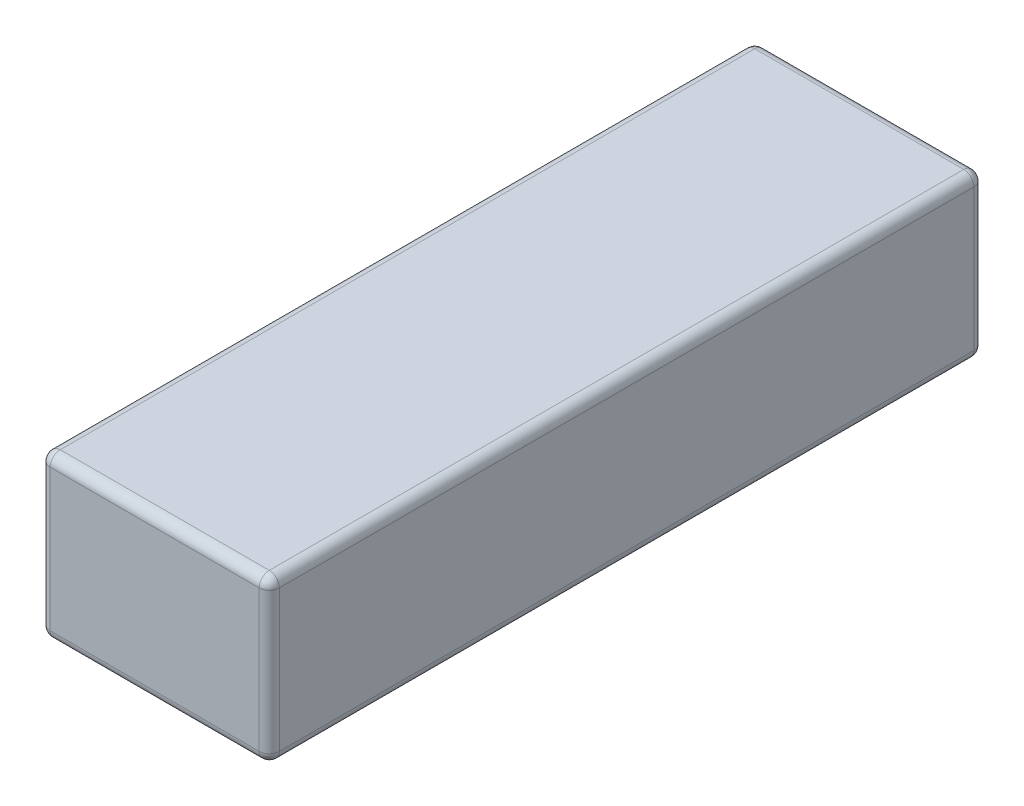
ISO-10303-21;
HEADER;
FILE_DESCRIPTION(('STEP AP214'),'2;1');
FILE_NAME('part.step','',(''),(''),'','','');
FILE_SCHEMA(('AUTOMOTIVE_DESIGN { 1 0 10303 214 1 1 1 1 }'));
ENDSEC;
DATA;
#1=APPLICATION_CONTEXT('core data for automotive mechanical design processes');
#2=APPLICATION_PROTOCOL_DEFINITION('international standard','automotive_design',2000,#1);
#3=PRODUCT_CONTEXT('',#1,'mechanical');
#4=PRODUCT('Part','Part','',(#3));
#5=PRODUCT_RELATED_PRODUCT_CATEGORY('part','',(#4));
#6=PRODUCT_DEFINITION_FORMATION('','',#4);
#7=PRODUCT_DEFINITION_CONTEXT('part definition',#1,'design');
#8=PRODUCT_DEFINITION('design','',#6,#7);
#9=PRODUCT_DEFINITION_SHAPE('','',#8);
#10=(LENGTH_UNIT() NAMED_UNIT(*) SI_UNIT(.MILLI.,.METRE.));
#11=(NAMED_UNIT(*) PLANE_ANGLE_UNIT() SI_UNIT($,.RADIAN.));
#12=(NAMED_UNIT(*) SI_UNIT($,.STERADIAN.) SOLID_ANGLE_UNIT());
#13=UNCERTAINTY_MEASURE_WITH_UNIT(LENGTH_MEASURE(1.E-05),#10,'distance_accuracy_value','');
#14=(GEOMETRIC_REPRESENTATION_CONTEXT(3) GLOBAL_UNCERTAINTY_ASSIGNED_CONTEXT((#13)) GLOBAL_UNIT_ASSIGNED_CONTEXT((#10,
#11,#12)) REPRESENTATION_CONTEXT('',''));
#15=CARTESIAN_POINT('',(0.,0.,0.));
#16=DIRECTION('',(0.,0.,1.));
#17=DIRECTION('',(1.,0.,0.));
#18=AXIS2_PLACEMENT_3D('',#15,#16,#17);
#19=CARTESIAN_POINT('',(-17.,24.,53.));
#20=DIRECTION('',(1.,0.,0.));
#21=DIRECTION('',(0.,0.,-1.));
#22=AXIS2_PLACEMENT_3D('',#19,#20,#21);
#23=PLANE('',#22);
#24=DIRECTION('',(0.,-1.,0.));
#25=VECTOR('',#24,1.);
#26=CARTESIAN_POINT('',(-17.,24.,-51.5));
#27=LINE('',#26,#25);
#28=CARTESIAN_POINT('',(-17.,22.5,-51.5));
#29=VERTEX_POINT('',#28);
#30=CARTESIAN_POINT('',(-17.,1.5,-51.5));
#31=VERTEX_POINT('',#30);
#32=EDGE_CURVE('E227',#29,#31,#27,.T.);
#33=ORIENTED_EDGE('',*,*,#32,.T.);
#34=DIRECTION('',(0.,0.,1.));
#35=VECTOR('',#34,1.);
#36=CARTESIAN_POINT('',(-17.,1.5,53.));
#37=LINE('',#36,#35);
#38=CARTESIAN_POINT('',(-17.,1.5,51.5));
#39=VERTEX_POINT('',#38);
#40=EDGE_CURVE('E231',#31,#39,#37,.T.);
#41=ORIENTED_EDGE('',*,*,#40,.T.);
#42=DIRECTION('',(0.,-1.,0.));
#43=VECTOR('',#42,1.);
#44=CARTESIAN_POINT('',(-17.,24.,51.5));
#45=LINE('',#44,#43);
#46=CARTESIAN_POINT('',(-17.,22.5,51.5));
#47=VERTEX_POINT('',#46);
#48=EDGE_CURVE('E224',#39,#47,#45,.F.);
#49=ORIENTED_EDGE('',*,*,#48,.T.);
#50=DIRECTION('',(0.,0.,1.));
#51=VECTOR('',#50,1.);
#52=CARTESIAN_POINT('',(-17.,22.5,-53.));
#53=LINE('',#52,#51);
#54=EDGE_CURVE('E221',#47,#29,#53,.F.);
#55=ORIENTED_EDGE('',*,*,#54,.T.);
#56=EDGE_LOOP('',(#33,#41,#49,#55));
#57=FACE_BOUND('',#56,.T.);
#58=ADVANCED_FACE('F45',(#57),#23,.F.);
#59=CARTESIAN_POINT('',(17.,24.,53.));
#60=DIRECTION('',(0.,0.,-1.));
#61=DIRECTION('',(-1.,0.,0.));
#62=AXIS2_PLACEMENT_3D('',#59,#60,#61);
#63=PLANE('',#62);
#64=DIRECTION('',(1.,0.,0.));
#65=VECTOR('',#64,1.);
#66=CARTESIAN_POINT('',(17.,1.5,53.));
#67=LINE('',#66,#65);
#68=CARTESIAN_POINT('',(-15.5,1.5,53.));
#69=VERTEX_POINT('',#68);
#70=CARTESIAN_POINT('',(15.5,1.5,53.));
#71=VERTEX_POINT('',#70);
#72=EDGE_CURVE('E190',#69,#71,#67,.T.);
#73=ORIENTED_EDGE('',*,*,#72,.T.);
#74=DIRECTION('',(0.,-1.,0.));
#75=VECTOR('',#74,1.);
#76=CARTESIAN_POINT('',(15.5,24.,53.));
#77=LINE('',#76,#75);
#78=CARTESIAN_POINT('',(15.5,22.5,53.));
#79=VERTEX_POINT('',#78);
#80=EDGE_CURVE('E193',#71,#79,#77,.F.);
#81=ORIENTED_EDGE('',*,*,#80,.T.);
#82=DIRECTION('',(1.,0.,0.));
#83=VECTOR('',#82,1.);
#84=CARTESIAN_POINT('',(-17.,22.5,53.));
#85=LINE('',#84,#83);
#86=CARTESIAN_POINT('',(-15.5,22.5,53.));
#87=VERTEX_POINT('',#86);
#88=EDGE_CURVE('E184',#79,#87,#85,.F.);
#89=ORIENTED_EDGE('',*,*,#88,.T.);
#90=DIRECTION('',(0.,-1.,0.));
#91=VECTOR('',#90,1.);
#92=CARTESIAN_POINT('',(-15.5,24.,53.));
#93=LINE('',#92,#91);
#94=EDGE_CURVE('E187',#87,#69,#93,.T.);
#95=ORIENTED_EDGE('',*,*,#94,.T.);
#96=EDGE_LOOP('',(#73,#81,#89,#95));
#97=FACE_BOUND('',#96,.T.);
#98=ADVANCED_FACE('F365',(#97),#63,.F.);
#99=CARTESIAN_POINT('',(17.,24.,53.));
#100=DIRECTION('',(-1.,0.,0.));
#101=DIRECTION('',(0.,0.,1.));
#102=AXIS2_PLACEMENT_3D('',#99,#100,#101);
#103=PLANE('',#102);
#104=DIRECTION('',(0.,0.,-1.));
#105=VECTOR('',#104,1.);
#106=CARTESIAN_POINT('',(17.,22.5,53.));
#107=LINE('',#106,#105);
#108=CARTESIAN_POINT('',(17.,22.5,-51.5));
#109=VERTEX_POINT('',#108);
#110=CARTESIAN_POINT('',(17.,22.5,51.5));
#111=VERTEX_POINT('',#110);
#112=EDGE_CURVE('E138',#109,#111,#107,.F.);
#113=ORIENTED_EDGE('',*,*,#112,.T.);
#114=DIRECTION('',(0.,-1.,0.));
#115=VECTOR('',#114,1.);
#116=CARTESIAN_POINT('',(17.,24.,51.5));
#117=LINE('',#116,#115);
#118=CARTESIAN_POINT('',(17.,1.5,51.5));
#119=VERTEX_POINT('',#118);
#120=EDGE_CURVE('E181',#111,#119,#117,.T.);
#121=ORIENTED_EDGE('',*,*,#120,.T.);
#122=DIRECTION('',(0.,0.,-1.));
#123=VECTOR('',#122,1.);
#124=CARTESIAN_POINT('',(17.,1.5,53.));
#125=LINE('',#124,#123);
#126=CARTESIAN_POINT('',(17.,1.5,-51.5));
#127=VERTEX_POINT('',#126);
#128=EDGE_CURVE('E141',#119,#127,#125,.T.);
#129=ORIENTED_EDGE('',*,*,#128,.T.);
#130=DIRECTION('',(0.,-1.,0.));
#131=VECTOR('',#130,1.);
#132=CARTESIAN_POINT('',(17.,24.,-51.5));
#133=LINE('',#132,#131);
#134=EDGE_CURVE('E133',#127,#109,#133,.F.);
#135=ORIENTED_EDGE('',*,*,#134,.T.);
#136=EDGE_LOOP('',(#113,#121,#129,#135));
#137=FACE_BOUND('',#136,.T.);
#138=ADVANCED_FACE('F135',(#137),#103,.F.);
#139=CARTESIAN_POINT('',(17.,24.,-53.));
#140=DIRECTION('',(0.,0.,1.));
#141=DIRECTION('',(1.,0.,0.));
#142=AXIS2_PLACEMENT_3D('',#139,#140,#141);
#143=PLANE('',#142);
#144=DIRECTION('',(-1.,0.,0.));
#145=VECTOR('',#144,1.);
#146=CARTESIAN_POINT('',(17.,22.5,-53.));
#147=LINE('',#146,#145);
#148=CARTESIAN_POINT('',(-15.5,22.5,-53.));
#149=VERTEX_POINT('',#148);
#150=CARTESIAN_POINT('',(15.5,22.5,-53.));
#151=VERTEX_POINT('',#150);
#152=EDGE_CURVE('E210',#149,#151,#147,.F.);
#153=ORIENTED_EDGE('',*,*,#152,.T.);
#154=DIRECTION('',(0.,-1.,0.));
#155=VECTOR('',#154,1.);
#156=CARTESIAN_POINT('',(15.5,24.,-53.));
#157=LINE('',#156,#155);
#158=CARTESIAN_POINT('',(15.5,1.5,-53.));
#159=VERTEX_POINT('',#158);
#160=EDGE_CURVE('E153',#151,#159,#157,.T.);
#161=ORIENTED_EDGE('',*,*,#160,.T.);
#162=DIRECTION('',(-1.,0.,0.));
#163=VECTOR('',#162,1.);
#164=CARTESIAN_POINT('',(17.,1.5,-53.));
#165=LINE('',#164,#163);
#166=CARTESIAN_POINT('',(-15.5,1.5,-53.));
#167=VERTEX_POINT('',#166);
#168=EDGE_CURVE('E216',#159,#167,#165,.T.);
#169=ORIENTED_EDGE('',*,*,#168,.T.);
#170=DIRECTION('',(0.,-1.,0.));
#171=VECTOR('',#170,1.);
#172=CARTESIAN_POINT('',(-15.5,24.,-53.));
#173=LINE('',#172,#171);
#174=EDGE_CURVE('E213',#167,#149,#173,.F.);
#175=ORIENTED_EDGE('',*,*,#174,.T.);
#176=EDGE_LOOP('',(#153,#161,#169,#175));
#177=FACE_BOUND('',#176,.T.);
#178=ADVANCED_FACE('F356',(#177),#143,.F.);
#179=CARTESIAN_POINT('',(0.,24.,0.));
#180=DIRECTION('',(0.,1.,0.));
#181=DIRECTION('',(0.,0.,1.));
#182=AXIS2_PLACEMENT_3D('',#179,#180,#181);
#183=PLANE('',#182);
#184=DIRECTION('',(0.,0.,-1.));
#185=VECTOR('',#184,1.);
#186=CARTESIAN_POINT('',(15.5,24.,-53.));
#187=LINE('',#186,#185);
#188=CARTESIAN_POINT('',(15.5,24.,51.5));
#189=VERTEX_POINT('',#188);
#190=CARTESIAN_POINT('',(15.5,24.,-51.5));
#191=VERTEX_POINT('',#190);
#192=EDGE_CURVE('E55',#189,#191,#187,.T.);
#193=ORIENTED_EDGE('',*,*,#192,.T.);
#194=DIRECTION('',(-1.,0.,0.));
#195=VECTOR('',#194,1.);
#196=CARTESIAN_POINT('',(-17.,24.,-51.5));
#197=LINE('',#196,#195);
#198=CARTESIAN_POINT('',(-15.5,24.,-51.5));
#199=VERTEX_POINT('',#198);
#200=EDGE_CURVE('E11',#191,#199,#197,.T.);
#201=ORIENTED_EDGE('',*,*,#200,.T.);
#202=DIRECTION('',(0.,0.,1.));
#203=VECTOR('',#202,1.);
#204=CARTESIAN_POINT('',(-15.5,24.,53.));
#205=LINE('',#204,#203);
#206=CARTESIAN_POINT('',(-15.5,24.,51.5));
#207=VERTEX_POINT('',#206);
#208=EDGE_CURVE('E234',#199,#207,#205,.T.);
#209=ORIENTED_EDGE('',*,*,#208,.T.);
#210=DIRECTION('',(1.,0.,0.));
#211=VECTOR('',#210,1.);
#212=CARTESIAN_POINT('',(17.,24.,51.5));
#213=LINE('',#212,#211);
#214=EDGE_CURVE('E66',#207,#189,#213,.T.);
#215=ORIENTED_EDGE('',*,*,#214,.T.);
#216=EDGE_LOOP('',(#193,#201,#209,#215));
#217=FACE_BOUND('',#216,.T.);
#218=ADVANCED_FACE('F358',(#217),#183,.T.);
#219=CARTESIAN_POINT('',(0.,0.,0.));
#220=DIRECTION('',(0.,1.,0.));
#221=DIRECTION('',(0.,0.,1.));
#222=AXIS2_PLACEMENT_3D('',#219,#220,#221);
#223=PLANE('',#222);
#224=DIRECTION('',(0.,0.,-1.));
#225=VECTOR('',#224,1.);
#226=CARTESIAN_POINT('',(15.5,0.,0.));
#227=LINE('',#226,#225);
#228=CARTESIAN_POINT('',(15.5,0.,-51.5));
#229=VERTEX_POINT('',#228);
#230=CARTESIAN_POINT('',(15.5,0.,51.5));
#231=VERTEX_POINT('',#230);
#232=EDGE_CURVE('E203',#229,#231,#227,.F.);
#233=ORIENTED_EDGE('',*,*,#232,.T.);
#234=DIRECTION('',(1.,0.,0.));
#235=VECTOR('',#234,1.);
#236=CARTESIAN_POINT('',(0.,0.,51.5));
#237=LINE('',#236,#235);
#238=CARTESIAN_POINT('',(-15.5,0.,51.5));
#239=VERTEX_POINT('',#238);
#240=EDGE_CURVE('E206',#231,#239,#237,.F.);
#241=ORIENTED_EDGE('',*,*,#240,.T.);
#242=DIRECTION('',(0.,0.,1.));
#243=VECTOR('',#242,1.);
#244=CARTESIAN_POINT('',(-15.5,0.,0.));
#245=LINE('',#244,#243);
#246=CARTESIAN_POINT('',(-15.5,0.,-51.5));
#247=VERTEX_POINT('',#246);
#248=EDGE_CURVE('E197',#239,#247,#245,.F.);
#249=ORIENTED_EDGE('',*,*,#248,.T.);
#250=DIRECTION('',(-1.,0.,0.));
#251=VECTOR('',#250,1.);
#252=CARTESIAN_POINT('',(0.,0.,-51.5));
#253=LINE('',#252,#251);
#254=EDGE_CURVE('E200',#247,#229,#253,.F.);
#255=ORIENTED_EDGE('',*,*,#254,.T.);
#256=EDGE_LOOP('',(#233,#241,#249,#255));
#257=FACE_BOUND('',#256,.T.);
#258=ADVANCED_FACE('F325',(#257),#223,.F.);
#259=CARTESIAN_POINT('',(-15.5,24.,-51.5));
#260=DIRECTION('',(0.,-1.,0.));
#261=DIRECTION('',(0.,0.,-1.));
#262=AXIS2_PLACEMENT_3D('',#259,#260,#261);
#263=CYLINDRICAL_SURFACE('',#262,1.5);
#264=CARTESIAN_POINT('',(-15.5,22.5,-51.5));
#265=DIRECTION('',(0.,1.,0.));
#266=DIRECTION('',(0.,0.,1.));
#267=AXIS2_PLACEMENT_3D('',#264,#265,#266);
#268=CIRCLE('',#267,1.5);
#269=EDGE_CURVE('E49',#149,#29,#268,.T.);
#270=ORIENTED_EDGE('',*,*,#269,.F.);
#271=ORIENTED_EDGE('',*,*,#174,.F.);
#272=CARTESIAN_POINT('',(-15.5,1.5,-51.5));
#273=DIRECTION('',(0.,-1.,0.));
#274=DIRECTION('',(0.,0.,-1.));
#275=AXIS2_PLACEMENT_3D('',#272,#273,#274);
#276=CIRCLE('',#275,1.5);
#277=EDGE_CURVE('E177',#31,#167,#276,.T.);
#278=ORIENTED_EDGE('',*,*,#277,.F.);
#279=ORIENTED_EDGE('',*,*,#32,.F.);
#280=EDGE_LOOP('',(#270,#271,#278,#279));
#281=FACE_BOUND('',#280,.T.);
#282=ADVANCED_FACE('F47',(#281),#263,.T.);
#283=CARTESIAN_POINT('',(-15.5,22.5,-51.5));
#284=DIRECTION('',(-1.,0.,0.));
#285=DIRECTION('',(0.,0.,1.));
#286=AXIS2_PLACEMENT_3D('',#283,#284,#285);
#287=SPHERICAL_SURFACE('',#286,1.5);
#288=CARTESIAN_POINT('',(-15.5,22.5,-51.5));
#289=DIRECTION('',(-1.,0.,0.));
#290=DIRECTION('',(0.,0.,1.));
#291=AXIS2_PLACEMENT_3D('',#288,#289,#290);
#292=CIRCLE('',#291,1.5);
#293=EDGE_CURVE('E301',#149,#199,#292,.F.);
#294=ORIENTED_EDGE('',*,*,#293,.F.);
#295=ORIENTED_EDGE('',*,*,#269,.T.);
#296=CARTESIAN_POINT('',(-15.5,22.5,-51.5));
#297=DIRECTION('',(0.,0.,-1.));
#298=DIRECTION('',(0.,1.,0.));
#299=AXIS2_PLACEMENT_3D('',#296,#297,#298);
#300=CIRCLE('',#299,1.5);
#301=EDGE_CURVE('E305',#199,#29,#300,.F.);
#302=ORIENTED_EDGE('',*,*,#301,.F.);
#303=EDGE_LOOP('',(#294,#295,#302));
#304=FACE_BOUND('',#303,.T.);
#305=ADVANCED_FACE('F351',(#304),#287,.T.);
#306=CARTESIAN_POINT('',(-15.5,1.5,-51.5));
#307=DIRECTION('',(0.,0.,-1.));
#308=DIRECTION('',(0.,1.,0.));
#309=AXIS2_PLACEMENT_3D('',#306,#307,#308);
#310=SPHERICAL_SURFACE('',#309,1.5);
#311=CARTESIAN_POINT('',(-15.5,1.5,-51.5));
#312=DIRECTION('',(0.,0.,-1.));
#313=DIRECTION('',(-1.,0.,0.));
#314=AXIS2_PLACEMENT_3D('',#311,#312,#313);
#315=CIRCLE('',#314,1.5);
#316=EDGE_CURVE('E293',#31,#247,#315,.F.);
#317=ORIENTED_EDGE('',*,*,#316,.F.);
#318=ORIENTED_EDGE('',*,*,#277,.T.);
#319=CARTESIAN_POINT('',(-15.5,1.5,-51.5));
#320=DIRECTION('',(-1.,0.,0.));
#321=DIRECTION('',(0.,0.,1.));
#322=AXIS2_PLACEMENT_3D('',#319,#320,#321);
#323=CIRCLE('',#322,1.5);
#324=EDGE_CURVE('E297',#247,#167,#323,.F.);
#325=ORIENTED_EDGE('',*,*,#324,.F.);
#326=EDGE_LOOP('',(#317,#318,#325));
#327=FACE_BOUND('',#326,.T.);
#328=ADVANCED_FACE('F314',(#327),#310,.T.);
#329=CARTESIAN_POINT('',(-15.5,22.5,0.));
#330=DIRECTION('',(0.,0.,-1.));
#331=DIRECTION('',(-1.,0.,0.));
#332=AXIS2_PLACEMENT_3D('',#329,#330,#331);
#333=CYLINDRICAL_SURFACE('',#332,1.5);
#334=ORIENTED_EDGE('',*,*,#301,.T.);
#335=ORIENTED_EDGE('',*,*,#54,.F.);
#336=CARTESIAN_POINT('',(-15.5,22.5,51.5));
#337=DIRECTION('',(0.,0.,1.));
#338=DIRECTION('',(1.,0.,0.));
#339=AXIS2_PLACEMENT_3D('',#336,#337,#338);
#340=CIRCLE('',#339,1.5);
#341=EDGE_CURVE('E285',#207,#47,#340,.T.);
#342=ORIENTED_EDGE('',*,*,#341,.F.);
#343=ORIENTED_EDGE('',*,*,#208,.F.);
#344=EDGE_LOOP('',(#334,#335,#342,#343));
#345=FACE_BOUND('',#344,.T.);
#346=ADVANCED_FACE('F346',(#345),#333,.T.);
#347=CARTESIAN_POINT('',(0.,22.5,-51.5));
#348=DIRECTION('',(1.,0.,0.));
#349=DIRECTION('',(0.,0.,-1.));
#350=AXIS2_PLACEMENT_3D('',#347,#348,#349);
#351=CYLINDRICAL_SURFACE('',#350,1.5);
#352=ORIENTED_EDGE('',*,*,#293,.T.);
#353=ORIENTED_EDGE('',*,*,#200,.F.);
#354=CARTESIAN_POINT('',(15.5,22.5,-51.5));
#355=DIRECTION('',(1.,0.,0.));
#356=DIRECTION('',(0.,0.,-1.));
#357=AXIS2_PLACEMENT_3D('',#354,#355,#356);
#358=CIRCLE('',#357,1.5);
#359=EDGE_CURVE('E158',#151,#191,#358,.T.);
#360=ORIENTED_EDGE('',*,*,#359,.F.);
#361=ORIENTED_EDGE('',*,*,#152,.F.);
#362=EDGE_LOOP('',(#352,#353,#360,#361));
#363=FACE_BOUND('',#362,.T.);
#364=ADVANCED_FACE('F354',(#363),#351,.T.);
#365=CARTESIAN_POINT('',(15.5,24.,-51.5));
#366=DIRECTION('',(0.,-1.,0.));
#367=DIRECTION('',(0.,0.,-1.));
#368=AXIS2_PLACEMENT_3D('',#365,#366,#367);
#369=CYLINDRICAL_SURFACE('',#368,1.5);
#370=CARTESIAN_POINT('',(15.5,1.5,-51.5));
#371=DIRECTION('',(0.,-1.,0.));
#372=DIRECTION('',(0.,0.,-1.));
#373=AXIS2_PLACEMENT_3D('',#370,#371,#372);
#374=CIRCLE('',#373,1.5);
#375=EDGE_CURVE('E159',#159,#127,#374,.T.);
#376=ORIENTED_EDGE('',*,*,#375,.F.);
#377=ORIENTED_EDGE('',*,*,#160,.F.);
#378=CARTESIAN_POINT('',(15.5,22.5,-51.5));
#379=DIRECTION('',(0.,1.,0.));
#380=DIRECTION('',(0.,0.,1.));
#381=AXIS2_PLACEMENT_3D('',#378,#379,#380);
#382=CIRCLE('',#381,1.5);
#383=EDGE_CURVE('E149',#109,#151,#382,.T.);
#384=ORIENTED_EDGE('',*,*,#383,.F.);
#385=ORIENTED_EDGE('',*,*,#134,.F.);
#386=EDGE_LOOP('',(#376,#377,#384,#385));
#387=FACE_BOUND('',#386,.T.);
#388=ADVANCED_FACE('F151',(#387),#369,.T.);
#389=CARTESIAN_POINT('',(17.,1.5,-51.5));
#390=DIRECTION('',(-1.,0.,0.));
#391=DIRECTION('',(0.,0.,1.));
#392=AXIS2_PLACEMENT_3D('',#389,#390,#391);
#393=CYLINDRICAL_SURFACE('',#392,1.5);
#394=ORIENTED_EDGE('',*,*,#324,.T.);
#395=ORIENTED_EDGE('',*,*,#168,.F.);
#396=CARTESIAN_POINT('',(15.5,1.5,-51.5));
#397=DIRECTION('',(1.,0.,0.));
#398=DIRECTION('',(0.,0.,-1.));
#399=AXIS2_PLACEMENT_3D('',#396,#397,#398);
#400=CIRCLE('',#399,1.5);
#401=EDGE_CURVE('E278',#229,#159,#400,.T.);
#402=ORIENTED_EDGE('',*,*,#401,.F.);
#403=ORIENTED_EDGE('',*,*,#254,.F.);
#404=EDGE_LOOP('',(#394,#395,#402,#403));
#405=FACE_BOUND('',#404,.T.);
#406=ADVANCED_FACE('F321',(#405),#393,.T.);
#407=CARTESIAN_POINT('',(-15.5,1.5,53.));
#408=DIRECTION('',(0.,0.,1.));
#409=DIRECTION('',(1.,0.,0.));
#410=AXIS2_PLACEMENT_3D('',#407,#408,#409);
#411=CYLINDRICAL_SURFACE('',#410,1.5);
#412=ORIENTED_EDGE('',*,*,#316,.T.);
#413=ORIENTED_EDGE('',*,*,#248,.F.);
#414=CARTESIAN_POINT('',(-15.5,1.5,51.5));
#415=DIRECTION('',(0.,0.,1.));
#416=DIRECTION('',(1.,0.,0.));
#417=AXIS2_PLACEMENT_3D('',#414,#415,#416);
#418=CIRCLE('',#417,1.5);
#419=EDGE_CURVE('E274',#39,#239,#418,.T.);
#420=ORIENTED_EDGE('',*,*,#419,.F.);
#421=ORIENTED_EDGE('',*,*,#40,.F.);
#422=EDGE_LOOP('',(#412,#413,#420,#421));
#423=FACE_BOUND('',#422,.T.);
#424=ADVANCED_FACE('F331',(#423),#411,.T.);
#425=CARTESIAN_POINT('',(-15.5,24.,51.5));
#426=DIRECTION('',(0.,-1.,0.));
#427=DIRECTION('',(0.,0.,-1.));
#428=AXIS2_PLACEMENT_3D('',#425,#426,#427);
#429=CYLINDRICAL_SURFACE('',#428,1.5);
#430=CARTESIAN_POINT('',(-15.5,22.5,51.5));
#431=DIRECTION('',(0.,1.,0.));
#432=DIRECTION('',(0.,0.,1.));
#433=AXIS2_PLACEMENT_3D('',#430,#431,#432);
#434=CIRCLE('',#433,1.5);
#435=EDGE_CURVE('E289',#47,#87,#434,.T.);
#436=ORIENTED_EDGE('',*,*,#435,.F.);
#437=ORIENTED_EDGE('',*,*,#48,.F.);
#438=CARTESIAN_POINT('',(-15.5,1.5,51.5));
#439=DIRECTION('',(0.,-1.,0.));
#440=DIRECTION('',(0.,0.,-1.));
#441=AXIS2_PLACEMENT_3D('',#438,#439,#440);
#442=CIRCLE('',#441,1.5);
#443=EDGE_CURVE('E270',#69,#39,#442,.T.);
#444=ORIENTED_EDGE('',*,*,#443,.F.);
#445=ORIENTED_EDGE('',*,*,#94,.F.);
#446=EDGE_LOOP('',(#436,#437,#444,#445));
#447=FACE_BOUND('',#446,.T.);
#448=ADVANCED_FACE('F338',(#447),#429,.T.);
#449=CARTESIAN_POINT('',(-15.5,22.5,51.5));
#450=DIRECTION('',(-1.,0.,0.));
#451=DIRECTION('',(0.,0.,1.));
#452=AXIS2_PLACEMENT_3D('',#449,#450,#451);
#453=SPHERICAL_SURFACE('',#452,1.5);
#454=ORIENTED_EDGE('',*,*,#341,.T.);
#455=ORIENTED_EDGE('',*,*,#435,.T.);
#456=CARTESIAN_POINT('',(-15.5,22.5,51.5));
#457=DIRECTION('',(-1.,0.,0.));
#458=DIRECTION('',(0.,-1.,0.));
#459=AXIS2_PLACEMENT_3D('',#456,#457,#458);
#460=CIRCLE('',#459,1.5);
#461=EDGE_CURVE('E166',#207,#87,#460,.F.);
#462=ORIENTED_EDGE('',*,*,#461,.F.);
#463=EDGE_LOOP('',(#454,#455,#462));
#464=FACE_BOUND('',#463,.T.);
#465=ADVANCED_FACE('F344',(#464),#453,.T.);
#466=CARTESIAN_POINT('',(15.5,22.5,-51.5));
#467=DIRECTION('',(0.,0.,-1.));
#468=DIRECTION('',(-1.,0.,0.));
#469=AXIS2_PLACEMENT_3D('',#466,#467,#468);
#470=SPHERICAL_SURFACE('',#469,1.5);
#471=ORIENTED_EDGE('',*,*,#383,.T.);
#472=ORIENTED_EDGE('',*,*,#359,.T.);
#473=CARTESIAN_POINT('',(15.5,22.5,-51.5));
#474=DIRECTION('',(0.,0.,-1.));
#475=DIRECTION('',(-1.,0.,0.));
#476=AXIS2_PLACEMENT_3D('',#473,#474,#475);
#477=CIRCLE('',#476,1.5);
#478=EDGE_CURVE('E162',#109,#191,#477,.F.);
#479=ORIENTED_EDGE('',*,*,#478,.F.);
#480=EDGE_LOOP('',(#471,#472,#479));
#481=FACE_BOUND('',#480,.T.);
#482=ADVANCED_FACE('F163',(#481),#470,.T.);
#483=CARTESIAN_POINT('',(15.5,1.5,-51.5));
#484=DIRECTION('',(0.,0.,-1.));
#485=DIRECTION('',(0.,1.,0.));
#486=AXIS2_PLACEMENT_3D('',#483,#484,#485);
#487=SPHERICAL_SURFACE('',#486,1.5);
#488=ORIENTED_EDGE('',*,*,#401,.T.);
#489=ORIENTED_EDGE('',*,*,#375,.T.);
#490=CARTESIAN_POINT('',(15.5,1.5,-51.5));
#491=DIRECTION('',(0.,0.,-1.));
#492=DIRECTION('',(-1.,0.,0.));
#493=AXIS2_PLACEMENT_3D('',#490,#491,#492);
#494=CIRCLE('',#493,1.5);
#495=EDGE_CURVE('E167',#229,#127,#494,.F.);
#496=ORIENTED_EDGE('',*,*,#495,.F.);
#497=EDGE_LOOP('',(#488,#489,#496));
#498=FACE_BOUND('',#497,.T.);
#499=ADVANCED_FACE('F405',(#498),#487,.T.);
#500=CARTESIAN_POINT('',(-15.5,1.5,51.5));
#501=DIRECTION('',(-1.,0.,0.));
#502=DIRECTION('',(0.,-1.,0.));
#503=AXIS2_PLACEMENT_3D('',#500,#501,#502);
#504=SPHERICAL_SURFACE('',#503,1.5);
#505=ORIENTED_EDGE('',*,*,#443,.T.);
#506=ORIENTED_EDGE('',*,*,#419,.T.);
#507=CARTESIAN_POINT('',(-15.5,1.5,51.5));
#508=DIRECTION('',(-1.,0.,0.));
#509=DIRECTION('',(0.,0.,1.));
#510=AXIS2_PLACEMENT_3D('',#507,#508,#509);
#511=CIRCLE('',#510,1.5);
#512=EDGE_CURVE('E261',#69,#239,#511,.F.);
#513=ORIENTED_EDGE('',*,*,#512,.F.);
#514=EDGE_LOOP('',(#505,#506,#513));
#515=FACE_BOUND('',#514,.T.);
#516=ADVANCED_FACE('F401',(#515),#504,.T.);
#517=CARTESIAN_POINT('',(0.,22.5,51.5));
#518=DIRECTION('',(-1.,0.,0.));
#519=DIRECTION('',(0.,0.,1.));
#520=AXIS2_PLACEMENT_3D('',#517,#518,#519);
#521=CYLINDRICAL_SURFACE('',#520,1.5);
#522=ORIENTED_EDGE('',*,*,#461,.T.);
#523=ORIENTED_EDGE('',*,*,#88,.F.);
#524=CARTESIAN_POINT('',(15.5,22.5,51.5));
#525=DIRECTION('',(1.,0.,0.));
#526=DIRECTION('',(0.,0.,-1.));
#527=AXIS2_PLACEMENT_3D('',#524,#525,#526);
#528=CIRCLE('',#527,1.5);
#529=EDGE_CURVE('E257',#189,#79,#528,.T.);
#530=ORIENTED_EDGE('',*,*,#529,.F.);
#531=ORIENTED_EDGE('',*,*,#214,.F.);
#532=EDGE_LOOP('',(#522,#523,#530,#531));
#533=FACE_BOUND('',#532,.T.);
#534=ADVANCED_FACE('F398',(#533),#521,.T.);
#535=CARTESIAN_POINT('',(15.5,22.5,0.));
#536=DIRECTION('',(0.,0.,1.));
#537=DIRECTION('',(1.,0.,0.));
#538=AXIS2_PLACEMENT_3D('',#535,#536,#537);
#539=CYLINDRICAL_SURFACE('',#538,1.5);
#540=ORIENTED_EDGE('',*,*,#478,.T.);
#541=ORIENTED_EDGE('',*,*,#192,.F.);
#542=CARTESIAN_POINT('',(15.5,22.5,51.5));
#543=DIRECTION('',(0.,0.,1.));
#544=DIRECTION('',(1.,0.,0.));
#545=AXIS2_PLACEMENT_3D('',#542,#543,#544);
#546=CIRCLE('',#545,1.5);
#547=EDGE_CURVE('E171',#111,#189,#546,.T.);
#548=ORIENTED_EDGE('',*,*,#547,.F.);
#549=ORIENTED_EDGE('',*,*,#112,.F.);
#550=EDGE_LOOP('',(#540,#541,#548,#549));
#551=FACE_BOUND('',#550,.T.);
#552=ADVANCED_FACE('F169',(#551),#539,.T.);
#553=CARTESIAN_POINT('',(15.5,1.5,53.));
#554=DIRECTION('',(0.,0.,-1.));
#555=DIRECTION('',(-1.,0.,0.));
#556=AXIS2_PLACEMENT_3D('',#553,#554,#555);
#557=CYLINDRICAL_SURFACE('',#556,1.5);
#558=ORIENTED_EDGE('',*,*,#495,.T.);
#559=ORIENTED_EDGE('',*,*,#128,.F.);
#560=CARTESIAN_POINT('',(15.5,1.5,51.5));
#561=DIRECTION('',(0.,0.,1.));
#562=DIRECTION('',(1.,0.,0.));
#563=AXIS2_PLACEMENT_3D('',#560,#561,#562);
#564=CIRCLE('',#563,1.5);
#565=EDGE_CURVE('E251',#231,#119,#564,.T.);
#566=ORIENTED_EDGE('',*,*,#565,.F.);
#567=ORIENTED_EDGE('',*,*,#232,.F.);
#568=EDGE_LOOP('',(#558,#559,#566,#567));
#569=FACE_BOUND('',#568,.T.);
#570=ADVANCED_FACE('F391',(#569),#557,.T.);
#571=CARTESIAN_POINT('',(17.,1.5,51.5));
#572=DIRECTION('',(1.,0.,0.));
#573=DIRECTION('',(0.,0.,-1.));
#574=AXIS2_PLACEMENT_3D('',#571,#572,#573);
#575=CYLINDRICAL_SURFACE('',#574,1.5);
#576=ORIENTED_EDGE('',*,*,#512,.T.);
#577=ORIENTED_EDGE('',*,*,#240,.F.);
#578=CARTESIAN_POINT('',(15.5,1.5,51.5));
#579=DIRECTION('',(1.,0.,0.));
#580=DIRECTION('',(0.,0.,-1.));
#581=AXIS2_PLACEMENT_3D('',#578,#579,#580);
#582=CIRCLE('',#581,1.5);
#583=EDGE_CURVE('E247',#71,#231,#582,.T.);
#584=ORIENTED_EDGE('',*,*,#583,.F.);
#585=ORIENTED_EDGE('',*,*,#72,.F.);
#586=EDGE_LOOP('',(#576,#577,#584,#585));
#587=FACE_BOUND('',#586,.T.);
#588=ADVANCED_FACE('F387',(#587),#575,.T.);
#589=CARTESIAN_POINT('',(15.5,22.5,51.5));
#590=DIRECTION('',(0.,1.,0.));
#591=DIRECTION('',(0.,0.,1.));
#592=AXIS2_PLACEMENT_3D('',#589,#590,#591);
#593=SPHERICAL_SURFACE('',#592,1.5);
#594=ORIENTED_EDGE('',*,*,#547,.T.);
#595=ORIENTED_EDGE('',*,*,#529,.T.);
#596=CARTESIAN_POINT('',(15.5,22.5,51.5));
#597=DIRECTION('',(0.,1.,0.));
#598=DIRECTION('',(0.,0.,1.));
#599=AXIS2_PLACEMENT_3D('',#596,#597,#598);
#600=CIRCLE('',#599,1.5);
#601=EDGE_CURVE('E244',#111,#79,#600,.F.);
#602=ORIENTED_EDGE('',*,*,#601,.F.);
#603=EDGE_LOOP('',(#594,#595,#602));
#604=FACE_BOUND('',#603,.T.);
#605=ADVANCED_FACE('F383',(#604),#593,.T.);
#606=CARTESIAN_POINT('',(15.5,1.5,51.5));
#607=DIRECTION('',(0.,-1.,0.));
#608=DIRECTION('',(0.,0.,-1.));
#609=AXIS2_PLACEMENT_3D('',#606,#607,#608);
#610=SPHERICAL_SURFACE('',#609,1.5);
#611=ORIENTED_EDGE('',*,*,#583,.T.);
#612=ORIENTED_EDGE('',*,*,#565,.T.);
#613=CARTESIAN_POINT('',(15.5,1.5,51.5));
#614=DIRECTION('',(0.,-1.,0.));
#615=DIRECTION('',(0.,0.,-1.));
#616=AXIS2_PLACEMENT_3D('',#613,#614,#615);
#617=CIRCLE('',#616,1.5);
#618=EDGE_CURVE('E241',#71,#119,#617,.F.);
#619=ORIENTED_EDGE('',*,*,#618,.F.);
#620=EDGE_LOOP('',(#611,#612,#619));
#621=FACE_BOUND('',#620,.T.);
#622=ADVANCED_FACE('F379',(#621),#610,.T.);
#623=CARTESIAN_POINT('',(15.5,24.,51.5));
#624=DIRECTION('',(0.,-1.,0.));
#625=DIRECTION('',(0.,0.,-1.));
#626=AXIS2_PLACEMENT_3D('',#623,#624,#625);
#627=CYLINDRICAL_SURFACE('',#626,1.5);
#628=ORIENTED_EDGE('',*,*,#601,.T.);
#629=ORIENTED_EDGE('',*,*,#80,.F.);
#630=ORIENTED_EDGE('',*,*,#618,.T.);
#631=ORIENTED_EDGE('',*,*,#120,.F.);
#632=EDGE_LOOP('',(#628,#629,#630,#631));
#633=FACE_BOUND('',#632,.T.);
#634=ADVANCED_FACE('F376',(#633),#627,.T.);
#635=CLOSED_SHELL('',(#58,#98,#138,#178,#218,#258,#282,#305,#328,#346,#364,#388,#406,#424,#448,
#465,#482,#499,#516,#534,#552,#570,#588,#605,#622,#634));
#636=MANIFOLD_SOLID_BREP('B2',#635);
#637=ADVANCED_BREP_SHAPE_REPRESENTATION('',(#18,#636),#14);
#638=SHAPE_DEFINITION_REPRESENTATION(#9,#637);
ENDSEC;
END-ISO-10303-21;
